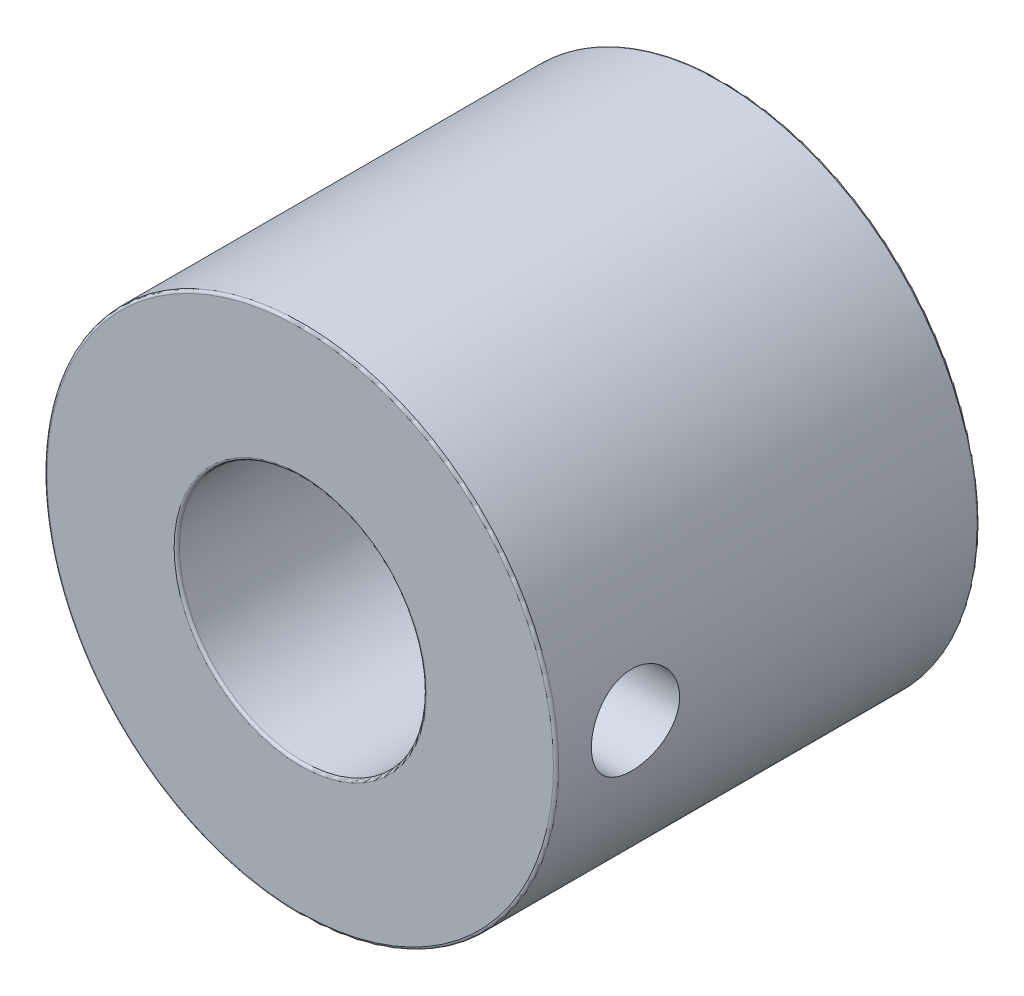
ISO-10303-21;
HEADER;
FILE_DESCRIPTION(('STEP AP214'),'2;1');
FILE_NAME('part.step','',(''),(''),'','','');
FILE_SCHEMA(('AUTOMOTIVE_DESIGN { 1 0 10303 214 1 1 1 1 }'));
ENDSEC;
DATA;
#1=APPLICATION_CONTEXT('core data for automotive mechanical design processes');
#2=APPLICATION_PROTOCOL_DEFINITION('international standard','automotive_design',2000,#1);
#3=PRODUCT_CONTEXT('',#1,'mechanical');
#4=PRODUCT('Part','Part','',(#3));
#5=PRODUCT_RELATED_PRODUCT_CATEGORY('part','',(#4));
#6=PRODUCT_DEFINITION_FORMATION('','',#4);
#7=PRODUCT_DEFINITION_CONTEXT('part definition',#1,'design');
#8=PRODUCT_DEFINITION('design','',#6,#7);
#9=PRODUCT_DEFINITION_SHAPE('','',#8);
#10=(LENGTH_UNIT() NAMED_UNIT(*) SI_UNIT(.MILLI.,.METRE.));
#11=(NAMED_UNIT(*) PLANE_ANGLE_UNIT() SI_UNIT($,.RADIAN.));
#12=(NAMED_UNIT(*) SI_UNIT($,.STERADIAN.) SOLID_ANGLE_UNIT());
#13=UNCERTAINTY_MEASURE_WITH_UNIT(LENGTH_MEASURE(1.E-05),#10,'distance_accuracy_value','');
#14=(GEOMETRIC_REPRESENTATION_CONTEXT(3) GLOBAL_UNCERTAINTY_ASSIGNED_CONTEXT((#13)) GLOBAL_UNIT_ASSIGNED_CONTEXT((#10,
#11,#12)) REPRESENTATION_CONTEXT('',''));
#15=CARTESIAN_POINT('',(0.,0.,0.));
#16=DIRECTION('',(0.,0.,1.));
#17=DIRECTION('',(1.,0.,0.));
#18=AXIS2_PLACEMENT_3D('',#15,#16,#17);
#19=CARTESIAN_POINT('',(0.,0.,48.));
#20=DIRECTION('',(0.,0.,-1.));
#21=DIRECTION('',(-1.,0.,0.));
#22=AXIS2_PLACEMENT_3D('',#19,#20,#21);
#23=CYLINDRICAL_SURFACE('',#22,29.);
#24=CARTESIAN_POINT('',(0.,0.,0.300000000000002));
#25=DIRECTION('',(0.,0.,1.));
#26=DIRECTION('',(1.,0.,0.));
#27=AXIS2_PLACEMENT_3D('',#24,#25,#26);
#28=CIRCLE('',#27,29.);
#29=CARTESIAN_POINT('',(29.,0.,0.300000000000002));
#30=VERTEX_POINT('',#29);
#31=EDGE_CURVE('E45',#30,#30,#28,.T.);
#32=ORIENTED_EDGE('',*,*,#31,.T.);
#33=EDGE_LOOP('',(#32));
#34=FACE_BOUND('',#33,.T.);
#35=CARTESIAN_POINT('',(0.,0.,47.7));
#36=DIRECTION('',(0.,0.,1.));
#37=DIRECTION('',(1.,0.,0.));
#38=AXIS2_PLACEMENT_3D('',#35,#36,#37);
#39=CIRCLE('',#38,29.);
#40=CARTESIAN_POINT('',(29.,0.,47.7));
#41=VERTEX_POINT('',#40);
#42=EDGE_CURVE('E50',#41,#41,#39,.F.);
#43=ORIENTED_EDGE('',*,*,#42,.T.);
#44=EDGE_LOOP('',(#43));
#45=FACE_BOUND('',#44,.T.);
#46=CARTESIAN_POINT('',(29.,0.,44.));
#47=CARTESIAN_POINT('',(29.0000010041572,-0.139366730999687,44.0000022424494));
#48=CARTESIAN_POINT('',(28.9989935146445,-0.278703487001926,43.994171314866));
#49=CARTESIAN_POINT('',(28.994993867993,-0.556417735275305,43.9708962986049));
#50=CARTESIAN_POINT('',(28.9920013271478,-0.694795036859398,43.9534499646898));
#51=CARTESIAN_POINT('',(28.984111586466,-0.969636236419775,43.9070605975793));
#52=CARTESIAN_POINT('',(28.979213219881,-1.10609890913449,43.8781105215499));
#53=CARTESIAN_POINT('',(28.9676472717491,-1.37610961672308,43.8089241555845));
#54=CARTESIAN_POINT('',(28.9609790409012,-1.50965656241991,43.7686837233038));
#55=CARTESIAN_POINT('',(28.946069273448,-1.77268338632854,43.6772807318518));
#56=CARTESIAN_POINT('',(28.9378296681615,-1.90216803220604,43.6261315711629));
#57=CARTESIAN_POINT('',(28.9199968020457,-2.15639281462493,43.5132384210894));
#58=CARTESIAN_POINT('',(28.9104030425439,-2.28113118175026,43.4514905268625));
#59=CARTESIAN_POINT('',(28.8901337262248,-2.52490140722549,43.3178909084556));
#60=CARTESIAN_POINT('',(28.8794586996812,-2.64393602101406,43.2460441303194));
#61=CARTESIAN_POINT('',(28.857311924844,-2.87560362060131,43.092701707488));
#62=CARTESIAN_POINT('',(28.845839880792,-2.98823420148496,43.0112024729533));
#63=CARTESIAN_POINT('',(28.822314330975,-3.20724727882162,42.8383841853778));
#64=CARTESIAN_POINT('',(28.8102566089828,-3.31356633507422,42.7469852994865));
#65=CARTESIAN_POINT('',(28.7859860257027,-3.51818559038157,42.5555598480556));
#66=CARTESIAN_POINT('',(28.773773108623,-3.61648280562814,42.4555301003811));
#67=CARTESIAN_POINT('',(28.7495421021919,-3.80431278584603,42.2475880390735));
#68=CARTESIAN_POINT('',(28.7375239551961,-3.8938481850112,42.1396781117177));
#69=CARTESIAN_POINT('',(28.7140124442942,-4.06359897737724,41.9166437638695));
#70=CARTESIAN_POINT('',(28.7025192755697,-4.14381092105733,41.8015166972545));
#71=CARTESIAN_POINT('',(28.6803190626315,-4.29478283149526,41.5641273676565));
#72=CARTESIAN_POINT('',(28.6696173942142,-4.36548043758763,41.4418249237761));
#73=CARTESIAN_POINT('',(28.6493866187259,-4.49633534516225,41.1915562431469));
#74=CARTESIAN_POINT('',(28.6398579503694,-4.55648870652884,41.0635879114789));
#75=CARTESIAN_POINT('',(28.6222613754863,-4.66575019828046,40.8029751096425));
#76=CARTESIAN_POINT('',(28.6141928465321,-4.7148630371878,40.6703326609002));
#77=CARTESIAN_POINT('',(28.5997455791012,-4.80171459398211,40.4012711898842));
#78=CARTESIAN_POINT('',(28.593367457065,-4.83944916324682,40.2648508098883));
#79=CARTESIAN_POINT('',(28.5771897834046,-4.93442482022914,39.8542017173274));
#80=CARTESIAN_POINT('',(28.5701461492155,-4.97464175167428,39.5757017993137));
#81=CARTESIAN_POINT('',(28.5643450518137,-5.00783867312309,39.0159776343015));
#82=CARTESIAN_POINT('',(28.5655869610415,-5.00082224065142,38.7347535952431));
#83=CARTESIAN_POINT('',(28.576134358113,-4.94018803659679,38.1806611696438));
#84=CARTESIAN_POINT('',(28.5853505121813,-4.88708652647722,37.9077347702711));
#85=CARTESIAN_POINT('',(28.6106718391743,-4.73658363161879,37.3747346061418));
#86=CARTESIAN_POINT('',(28.6267772634383,-4.63918063063214,37.1146613106877));
#87=CARTESIAN_POINT('',(28.6641571529568,-4.40232551215854,36.6132000359109));
#88=CARTESIAN_POINT('',(28.6854576767706,-4.26266053134075,36.3719146081918));
#89=CARTESIAN_POINT('',(28.7308101505286,-3.94539580489147,35.9160094833518));
#90=CARTESIAN_POINT('',(28.754862337655,-3.76779278801162,35.7013920882365));
#91=CARTESIAN_POINT('',(28.8033998143189,-3.37688791907062,35.3019264873065));
#92=CARTESIAN_POINT('',(28.8278866139267,-3.16314334976661,35.1175114183905));
#93=CARTESIAN_POINT('',(28.8742395282066,-2.70751578724515,34.7870972200359));
#94=CARTESIAN_POINT('',(28.8961056237204,-2.46563258834985,34.6410983714242));
#95=CARTESIAN_POINT('',(28.9347877434901,-1.96017493788063,34.391615094034));
#96=CARTESIAN_POINT('',(28.9515990057832,-1.69658032871544,34.2881707206243));
#97=CARTESIAN_POINT('',(28.9782394811635,-1.15540370028351,34.1271442505753));
#98=CARTESIAN_POINT('',(28.9880693198462,-0.877822936684406,34.0695580445936));
#99=CARTESIAN_POINT('',(28.9995547913353,-0.320284941882539,34.0024738874067));
#100=CARTESIAN_POINT('',(29.0013114394535,-0.0404012282032698,33.9923816324154));
#101=CARTESIAN_POINT('',(28.9967299015726,0.517056874429956,34.0189848576703));
#102=CARTESIAN_POINT('',(28.9903920496879,0.7946313582254,34.0556784067509));
#103=CARTESIAN_POINT('',(28.9703962675713,1.33774292205082,34.174317341895));
#104=CARTESIAN_POINT('',(28.9567862279156,1.60334656583138,34.2559667794515));
#105=CARTESIAN_POINT('',(28.9237658700363,2.11709545870728,34.4618830847517));
#106=CARTESIAN_POINT('',(28.9043552073953,2.36523967005135,34.58615248316));
#107=CARTESIAN_POINT('',(28.8616356376916,2.83959538930937,34.8751298853753));
#108=CARTESIAN_POINT('',(28.8382918064097,3.06557883504362,35.0402069868542));
#109=CARTESIAN_POINT('',(28.7903962824341,3.48684889826849,35.4056093510139));
#110=CARTESIAN_POINT('',(28.7658444955532,3.6821331170692,35.6059373654422));
#111=CARTESIAN_POINT('',(28.7179711467065,4.03867934173458,36.0388234958714));
#112=CARTESIAN_POINT('',(28.6946663084093,4.19953870802048,36.271715358476));
#113=CARTESIAN_POINT('',(28.6522446660876,4.47985077256473,36.7615756460067));
#114=CARTESIAN_POINT('',(28.6331277227411,4.59930484836228,37.0185432695794));
#115=CARTESIAN_POINT('',(28.6013712766186,4.79282611598803,37.5481089359185));
#116=CARTESIAN_POINT('',(28.5887038141159,4.86708949649444,37.8206337143807));
#117=CARTESIAN_POINT('',(28.571219912611,4.96871854072435,38.3746834102611));
#118=CARTESIAN_POINT('',(28.5664027381917,4.99608859743879,38.6562074821035));
#119=CARTESIAN_POINT('',(28.5654748048149,5.00135250942943,39.0767706540787));
#120=CARTESIAN_POINT('',(28.5661913921757,4.99727688543392,39.2158053750216));
#121=CARTESIAN_POINT('',(28.5696329683345,4.97757021228369,39.4930143513359));
#122=CARTESIAN_POINT('',(28.5723572013667,4.96194351145368,39.6311889107763));
#123=CARTESIAN_POINT('',(28.5797395705759,4.91924238538872,39.9057448166914));
#124=CARTESIAN_POINT('',(28.5843983952443,4.89216388456995,40.0421255069109));
#125=CARTESIAN_POINT('',(28.5955116540725,4.82678085002326,40.3120438266035));
#126=CARTESIAN_POINT('',(28.6019654428131,4.78848035114943,40.4455824594559));
#127=CARTESIAN_POINT('',(28.6164768328185,4.70098030566849,40.7088012297529));
#128=CARTESIAN_POINT('',(28.6245328427721,4.65179156772486,40.8384850500263));
#129=CARTESIAN_POINT('',(28.6420203727133,4.54287443064862,41.0931961655395));
#130=CARTESIAN_POINT('',(28.6514514007742,4.48314979924044,41.2182251061111));
#131=CARTESIAN_POINT('',(28.6714298538147,4.35355121249048,41.4628768189198));
#132=CARTESIAN_POINT('',(28.6819777202866,4.28367323938171,41.5824974263475));
#133=CARTESIAN_POINT('',(28.7038889424544,4.13430201419716,41.8154366814547));
#134=CARTESIAN_POINT('',(28.7152520120228,4.05481212914744,41.9287575157386));
#135=CARTESIAN_POINT('',(28.7386352656951,3.88564364103337,42.1498250011507));
#136=CARTESIAN_POINT('',(28.7506620944525,3.79584551194426,42.2574795045769));
#137=CARTESIAN_POINT('',(28.7748918319318,3.6075756882054,42.4648232657103));
#138=CARTESIAN_POINT('',(28.7870946764085,3.50910709445367,42.5645153469614));
#139=CARTESIAN_POINT('',(28.8113468717635,3.30408094234383,42.7553527380429));
#140=CARTESIAN_POINT('',(28.8233961268922,3.19751860112346,42.8464929220455));
#141=CARTESIAN_POINT('',(28.8469930440314,2.97712413173047,43.0194963434016));
#142=CARTESIAN_POINT('',(28.8585408894798,2.86329470047982,43.1013629913644));
#143=CARTESIAN_POINT('',(28.8809050923807,2.62818765872045,43.2558867171667));
#144=CARTESIAN_POINT('',(28.8917150057657,2.50685865476556,43.3284665668212));
#145=CARTESIAN_POINT('',(28.9121923920832,2.25846290248807,43.4631038536355));
#146=CARTESIAN_POINT('',(28.9218602850511,2.13139828764012,43.525165163192));
#147=CARTESIAN_POINT('',(28.9397768246268,1.87246873244622,43.6382975502436));
#148=CARTESIAN_POINT('',(28.9480264356427,1.740607128485,43.6893761018016));
#149=CARTESIAN_POINT('',(28.9628773918787,1.47299176899593,43.7801952783112));
#150=CARTESIAN_POINT('',(28.9694790850081,1.3372388417645,43.819938296679));
#151=CARTESIAN_POINT('',(28.983275327006,1.00405515934851,43.9023030068049));
#152=CARTESIAN_POINT('',(28.9895172784288,0.805061904222418,43.9388948625982));
#153=CARTESIAN_POINT('',(28.9978788476899,0.40402474044416,43.9877415005305));
#154=CARTESIAN_POINT('',(28.9999985446989,0.201980890455928,43.9999967500714));
#155=CARTESIAN_POINT('',(29.,0.,44.));
#156=B_SPLINE_CURVE_WITH_KNOTS('',3,(#46,#47,#48,#49,#50,#51,#52,#53,#54,#55,#56,#57,#58,#59,
#60,#61,#62,#63,#64,#65,#66,#67,#68,#69,#70,#71,#72,#73,#74,#75,#76,#77,#78,#79,#80,#81,#82,#83,
#84,#85,#86,#87,#88,#89,#90,#91,#92,#93,#94,#95,#96,#97,#98,#99,#100,#101,#102,#103,#104,#105,
#106,#107,#108,#109,#110,#111,#112,#113,#114,#115,#116,#117,#118,#119,#120,#121,#122,#123,#124,
#125,#126,#127,#128,#129,#130,#131,#132,#133,#134,#135,#136,#137,#138,#139,#140,#141,#142,#143,
#144,#145,#146,#147,#148,#149,#150,#151,#152,#153,#154,#155),.UNSPECIFIED.,.T.,.F.,(4,2,2,2,2,2,
2,2,2,2,2,2,2,2,2,2,2,2,2,2,2,2,2,2,2,2,2,2,2,2,2,2,2,2,2,2,2,2,2,2,2,2,2,2,2,2,2,2,2,2,2,2,2,2,
4),(0.,0.417923102553967,0.835927012358662,1.2541872282433,1.67260110169198,2.09050399409306,
2.50856118430128,2.92641433504709,3.34442338021042,3.76609743729152,4.18792763229172,
4.60963061411037,5.03148912558549,5.45599040689023,5.88064997691835,6.30512809461535,
6.72976079433283,7.56975479740566,8.40968517880939,9.24032606712403,10.0709972620759,
10.9059240272709,11.7409228140144,12.5870092660533,13.4331019029055,14.2799891314406,
15.1268004620138,15.9629867402739,16.7991385046063,17.6298505052784,18.4606118400541,
19.2991813551393,20.1378163594807,20.9857805877793,21.8337166019031,22.6779446650703,
23.5220936361884,23.9389759618157,24.3557014347821,24.7725753412475,25.189299544815,
25.6056119102908,26.0217756996391,26.4381046194388,26.8542881205755,27.2759079760025,
27.697377651377,28.119098354387,28.5406634504369,28.9655333425465,29.3902464775927,
29.8146696626615,30.2390031673817,30.8447008187417,31.4503868371369),.UNSPECIFIED.);
#157=CARTESIAN_POINT('',(29.,0.,44.));
#158=VERTEX_POINT('',#157);
#159=EDGE_CURVE('E87',#158,#158,#156,.T.);
#160=ORIENTED_EDGE('',*,*,#159,.F.);
#161=EDGE_LOOP('',(#160));
#162=FACE_BOUND('',#161,.T.);
#163=ADVANCED_FACE('F37',(#34,#45,#162),#23,.T.);
#164=CARTESIAN_POINT('',(0.,0.,0.));
#165=DIRECTION('',(0.,0.,1.));
#166=DIRECTION('',(1.,0.,0.));
#167=AXIS2_PLACEMENT_3D('',#164,#165,#166);
#168=CYLINDRICAL_SURFACE('',#167,14.);
#169=CARTESIAN_POINT('',(0.,0.,25.3));
#170=DIRECTION('',(0.,0.,-1.));
#171=DIRECTION('',(-1.,0.,0.));
#172=AXIS2_PLACEMENT_3D('',#169,#170,#171);
#173=CIRCLE('',#172,14.);
#174=CARTESIAN_POINT('',(-14.,0.,25.3));
#175=VERTEX_POINT('',#174);
#176=EDGE_CURVE('E69',#175,#175,#173,.T.);
#177=ORIENTED_EDGE('',*,*,#176,.T.);
#178=EDGE_LOOP('',(#177));
#179=FACE_BOUND('',#178,.T.);
#180=CARTESIAN_POINT('',(0.,0.,47.7));
#181=DIRECTION('',(0.,0.,1.));
#182=DIRECTION('',(1.,0.,0.));
#183=AXIS2_PLACEMENT_3D('',#180,#181,#182);
#184=CIRCLE('',#183,14.);
#185=CARTESIAN_POINT('',(14.,0.,47.7));
#186=VERTEX_POINT('',#185);
#187=EDGE_CURVE('E73',#186,#186,#184,.T.);
#188=ORIENTED_EDGE('',*,*,#187,.T.);
#189=EDGE_LOOP('',(#188));
#190=FACE_BOUND('',#189,.T.);
#191=CARTESIAN_POINT('',(14.,0.,34.));
#192=CARTESIAN_POINT('',(14.0000002519426,-0.135809737919824,33.9999996489062));
#193=CARTESIAN_POINT('',(13.9980194471187,-0.271614291106981,34.0055376206375));
#194=CARTESIAN_POINT('',(13.9901497229004,-0.542257020230889,34.0276367317464));
#195=CARTESIAN_POINT('',(13.9842594799445,-0.677094853246565,34.0442016043471));
#196=CARTESIAN_POINT('',(13.9687325117163,-0.944706220002116,34.0881866642127));
#197=CARTESIAN_POINT('',(13.9590974054114,-1.07748062003744,34.115602160664));
#198=CARTESIAN_POINT('',(13.9363349467423,-1.34013264362942,34.1810403733551));
#199=CARTESIAN_POINT('',(13.9232062410631,-1.47000912344286,34.2190672003827));
#200=CARTESIAN_POINT('',(13.8938342150931,-1.72565362119309,34.3052935205961));
#201=CARTESIAN_POINT('',(13.8775979412044,-1.85143019462852,34.3534700238517));
#202=CARTESIAN_POINT('',(13.8424113291469,-2.09839082390053,34.4596418228038));
#203=CARTESIAN_POINT('',(13.8234599859859,-2.21957315806502,34.5176407557604));
#204=CARTESIAN_POINT('',(13.7632361558461,-2.5750514260562,34.7057203979632));
#205=CARTESIAN_POINT('',(13.7185691156471,-2.80148404260274,34.8499537032511));
#206=CARTESIAN_POINT('',(13.6229449969461,-3.23521018737559,35.1776926987683));
#207=CARTESIAN_POINT('',(13.5718218038497,-3.44154890844615,35.3624025243698));
#208=CARTESIAN_POINT('',(13.4698651943805,-3.82117539449033,35.7635276745051));
#209=CARTESIAN_POINT('',(13.4190318586256,-3.99445436166886,35.9799514116651));
#210=CARTESIAN_POINT('',(13.3463548051795,-4.22869107129882,36.3281624471916));
#211=CARTESIAN_POINT('',(13.322357427084,-4.30350471308028,36.4504050494653));
#212=CARTESIAN_POINT('',(13.276649558234,-4.44251308945513,36.7011753500471));
#213=CARTESIAN_POINT('',(13.2549381581178,-4.5067120524072,36.8297005191309));
#214=CARTESIAN_POINT('',(13.2144936706828,-4.62396036382352,37.0922090905549));
#215=CARTESIAN_POINT('',(13.1957610120845,-4.67700810768227,37.2261932751137));
#216=CARTESIAN_POINT('',(13.161913454543,-4.77143074296403,37.4985963048509));
#217=CARTESIAN_POINT('',(13.1467968545773,-4.81281112444964,37.6370130300438));
#218=CARTESIAN_POINT('',(13.121191024673,-4.88217802905966,37.9120250140659));
#219=CARTESIAN_POINT('',(13.1105496468107,-4.91060827509872,38.0484942249662));
#220=CARTESIAN_POINT('',(13.0934633224998,-4.95598710062016,38.3235328952594));
#221=CARTESIAN_POINT('',(13.0870165796139,-4.97294059537926,38.4621014295218));
#222=CARTESIAN_POINT('',(13.0785367055753,-4.99519971662274,38.7402904458839));
#223=CARTESIAN_POINT('',(13.0765030776297,-5.00050665418347,38.8799108078016));
#224=CARTESIAN_POINT('',(13.0769196730582,-4.999417266875,39.1590965394367));
#225=CARTESIAN_POINT('',(13.0793697443865,-4.9930213388595,39.2986619108584));
#226=CARTESIAN_POINT('',(13.0884164555786,-4.96925582787826,39.5691454428228));
#227=CARTESIAN_POINT('',(13.0947832015803,-4.95249439155337,39.7001252680759));
#228=CARTESIAN_POINT('',(13.1112572434917,-4.90871467197178,39.9601626011858));
#229=CARTESIAN_POINT('',(13.1213657892446,-4.88169296148015,40.0892194517263));
#230=CARTESIAN_POINT('',(13.1450167120839,-4.817644659942,40.3444711018331));
#231=CARTESIAN_POINT('',(13.1585581647139,-4.78062076223466,40.4706666619723));
#232=CARTESIAN_POINT('',(13.1886773774888,-4.69688836619737,40.7194463048664));
#233=CARTESIAN_POINT('',(13.2052562987683,-4.65017616340986,40.8420289856502));
#234=CARTESIAN_POINT('',(13.2594921589773,-4.49423824121893,41.2074006206498));
#235=CARTESIAN_POINT('',(13.3012259345047,-4.37029651313278,41.4434997683801));
#236=CARTESIAN_POINT('',(13.3908924158961,-4.08729285529161,41.8921522229325));
#237=CARTESIAN_POINT('',(13.4388271130899,-3.92821963194589,42.1046979250449));
#238=CARTESIAN_POINT('',(13.5390490871924,-3.56806665841638,42.5139076673079));
#239=CARTESIAN_POINT('',(13.5914242329658,-3.36502761599936,42.7088326312144));
#240=CARTESIAN_POINT('',(13.6921097086614,-2.92852270488315,43.0623464533435));
#241=CARTESIAN_POINT('',(13.7404195241964,-2.69505299528129,43.2209307177292));
#242=CARTESIAN_POINT('',(13.8283399097023,-2.20020095435867,43.4989603760333));
#243=CARTESIAN_POINT('',(13.8678306254663,-1.93849829448506,43.6178762502915));
#244=CARTESIAN_POINT('',(13.9327833716819,-1.39704686664781,43.8094318777166));
#245=CARTESIAN_POINT('',(13.9582510295517,-1.11730538803626,43.8820901957571));
#246=CARTESIAN_POINT('',(13.991324045948,-0.562410193206383,43.9758382307177));
#247=CARTESIAN_POINT('',(13.9997420700812,-0.287701200751388,43.999276193498));
#248=CARTESIAN_POINT('',(14.000245967713,0.261818717565057,44.0006903119603));
#249=CARTESIAN_POINT('',(13.9923350700279,0.536629612533592,43.9786754553026));
#250=CARTESIAN_POINT('',(13.96160696813,1.06873750606474,43.8916275309154));
#251=CARTESIAN_POINT('',(13.939308240694,1.32631209719197,43.8280897873378));
#252=CARTESIAN_POINT('',(13.882565031643,1.82699848697875,43.6617275116848));
#253=CARTESIAN_POINT('',(13.8481189730829,2.07010840306846,43.5588978786607));
#254=CARTESIAN_POINT('',(13.7693143482216,2.54263735557131,43.3136796092455));
#255=CARTESIAN_POINT('',(13.7247035735895,2.77147674291151,43.1702568930472));
#256=CARTESIAN_POINT('',(13.6305695865086,3.20255291901187,42.8491551592249));
#257=CARTESIAN_POINT('',(13.5810446916018,3.40478054113731,42.6714643893896));
#258=CARTESIAN_POINT('',(13.4793142279669,3.78806872243883,42.2757008253064));
#259=CARTESIAN_POINT('',(13.4271043972475,3.96746111928894,42.0559979903404));
#260=CARTESIAN_POINT('',(13.353186072821,4.20707029265235,41.7056737540284));
#261=CARTESIAN_POINT('',(13.3292666629599,4.282062011313,41.5853608633976));
#262=CARTESIAN_POINT('',(13.2835956994504,4.4217048104309,41.3385037914957));
#263=CARTESIAN_POINT('',(13.2618432357766,4.4863602386487,41.2119622596321));
#264=CARTESIAN_POINT('',(13.2211521289455,4.60489690992007,40.9532560459585));
#265=CARTESIAN_POINT('',(13.2022179096588,4.65876125884398,40.8210829337869));
#266=CARTESIAN_POINT('',(13.1678303323927,4.75508788562331,40.5522602584935));
#267=CARTESIAN_POINT('',(13.1523755162917,4.79755494120744,40.4156125981343));
#268=CARTESIAN_POINT('',(13.12547110679,4.87068051581479,40.1388390355153));
#269=CARTESIAN_POINT('',(13.1140205488036,4.90134187889161,39.9987139796477));
#270=CARTESIAN_POINT('',(13.0955286528397,4.95053767017168,39.7160657004277));
#271=CARTESIAN_POINT('',(13.0884870464724,4.96907283654582,39.5735426235944));
#272=CARTESIAN_POINT('',(13.0793469225384,4.9930788546979,39.2957127516861));
#273=CARTESIAN_POINT('',(13.0769817579263,4.99925470157819,39.160475192421));
#274=CARTESIAN_POINT('',(13.0764603957771,5.00061847355673,38.8898883107568));
#275=CARTESIAN_POINT('',(13.0783056225173,4.99580268043916,38.7545389660252));
#276=CARTESIAN_POINT('',(13.0861457297444,4.97522963503318,38.4848595829593));
#277=CARTESIAN_POINT('',(13.0921387237547,4.95947735683807,38.3505291092925));
#278=CARTESIAN_POINT('',(13.1080794092757,4.91719059273383,38.0837665065739));
#279=CARTESIAN_POINT('',(13.1180285884568,4.89065205071166,37.9513351110759));
#280=CARTESIAN_POINT('',(13.1412661885936,4.82785805334529,37.692699377124));
#281=CARTESIAN_POINT('',(13.1544628914362,4.79186791799649,37.5664223757394));
#282=CARTESIAN_POINT('',(13.1839237471819,4.71020497541157,37.3173923367375));
#283=CARTESIAN_POINT('',(13.2001889807938,4.6645287561192,37.1946405582751));
#284=CARTESIAN_POINT('',(13.2529164837268,4.51349426075883,36.8328507031323));
#285=CARTESIAN_POINT('',(13.2933294326143,4.3940816819264,36.6000802155087));
#286=CARTESIAN_POINT('',(13.3825459898299,4.11460292355305,36.1461153839393));
#287=CARTESIAN_POINT('',(13.4316625088261,3.95283925958625,35.9260378771458));
#288=CARTESIAN_POINT('',(13.5316137261424,3.59578542291728,35.5151310275802));
#289=CARTESIAN_POINT('',(13.5824489402755,3.40048511219727,35.3243105622296));
#290=CARTESIAN_POINT('',(13.6572247632491,3.08107053558581,35.0595151725912));
#291=CARTESIAN_POINT('',(13.6824529349607,2.96730195298126,34.973145743924));
#292=CARTESIAN_POINT('',(13.7312573259649,2.73256556739149,34.8103154305465));
#293=CARTESIAN_POINT('',(13.7548341552065,2.6116004534161,34.7338508783567));
#294=CARTESIAN_POINT('',(13.7996836066846,2.36319109186863,34.5913898114045));
#295=CARTESIAN_POINT('',(13.8209553479672,2.23574439432751,34.5253972943808));
#296=CARTESIAN_POINT('',(13.8605711546424,1.97532322487609,34.4044919282371));
#297=CARTESIAN_POINT('',(13.8789164945784,1.84235119141244,34.3495742528936));
#298=CARTESIAN_POINT('',(13.9122340622159,1.57114424812455,34.2510614421704));
#299=CARTESIAN_POINT('',(13.9271900336805,1.43288754312077,34.2075207270477));
#300=CARTESIAN_POINT('',(13.953163193027,1.15282395672585,34.1325571177426));
#301=CARTESIAN_POINT('',(13.9641820514713,1.01101860846044,34.1011290835637));
#302=CARTESIAN_POINT('',(13.9819512046771,0.724964125001943,34.0507054044607));
#303=CARTESIAN_POINT('',(13.9887019632778,0.580715257110368,34.0317084085756));
#304=CARTESIAN_POINT('',(13.9977260889503,0.290975558507285,34.0063562813388));
#305=CARTESIAN_POINT('',(13.9999997301091,0.145484804371126,34.0000003761057));
#306=CARTESIAN_POINT('',(14.,0.,34.));
#307=B_SPLINE_CURVE_WITH_KNOTS('',3,(#191,#192,#193,#194,#195,#196,#197,#198,#199,#200,#201,
#202,#203,#204,#205,#206,#207,#208,#209,#210,#211,#212,#213,#214,#215,#216,#217,#218,#219,#220,
#221,#222,#223,#224,#225,#226,#227,#228,#229,#230,#231,#232,#233,#234,#235,#236,#237,#238,#239,
#240,#241,#242,#243,#244,#245,#246,#247,#248,#249,#250,#251,#252,#253,#254,#255,#256,#257,#258,
#259,#260,#261,#262,#263,#264,#265,#266,#267,#268,#269,#270,#271,#272,#273,#274,#275,#276,#277,
#278,#279,#280,#281,#282,#283,#284,#285,#286,#287,#288,#289,#290,#291,#292,#293,#294,#295,#296,
#297,#298,#299,#300,#301,#302,#303,#304,#305,#306),.UNSPECIFIED.,.T.,.F.,(4,2,2,2,2,2,2,2,2,2,2,
2,2,2,2,2,2,2,2,2,2,2,2,2,2,2,2,2,2,2,2,2,2,2,2,2,2,2,2,2,2,2,2,2,2,2,2,2,2,2,2,2,2,2,2,2,2,4),
(0.,0.407293549367724,0.814725060573495,1.22198062785582,1.62939418390025,2.03589464693377,
2.44254596814073,3.25520135843811,4.09647500881856,4.93797222592689,5.37346750186923,
5.80878887805696,6.24417285203164,6.67935161341721,7.098226208036,7.51692129285397,
7.93556924190606,8.35420299452807,8.75034112612816,9.14661169614764,9.54277566657626,
9.93909139597209,10.7449687808383,11.5511056061663,12.4060188501517,13.2610401043917,
14.1270562827215,14.9927246771604,15.8160563856906,16.6392253074655,17.4342723235055,
18.2294225891648,19.0470029265114,19.8648641528353,20.7256534802194,21.1565526491281,
21.5872700890202,22.0186566639974,22.449862118888,22.8809636290183,23.3120388938047,
23.7177313781028,24.1235611190587,24.5292064027856,24.935004368452,25.330444148891,
25.7260234605165,26.5165753855613,27.3456507182852,28.1749771203856,28.6096896421885,
29.0442407400284,29.4789573323412,29.9134840713814,30.3500527626513,30.7864359921976,
31.2227717892929,31.6590808733025),.UNSPECIFIED.);
#308=CARTESIAN_POINT('',(14.,0.,34.));
#309=VERTEX_POINT('',#308);
#310=EDGE_CURVE('E78',#309,#309,#307,.T.);
#311=ORIENTED_EDGE('',*,*,#310,.F.);
#312=EDGE_LOOP('',(#311));
#313=FACE_BOUND('',#312,.T.);
#314=ADVANCED_FACE('F90',(#179,#190,#313),#168,.F.);
#315=CARTESIAN_POINT('',(0.,0.,48.));
#316=DIRECTION('',(0.,0.,1.));
#317=DIRECTION('',(1.,0.,0.));
#318=AXIS2_PLACEMENT_3D('',#315,#316,#317);
#319=PLANE('',#318);
#320=CARTESIAN_POINT('',(0.,0.,48.));
#321=DIRECTION('',(0.,0.,1.));
#322=DIRECTION('',(1.,0.,0.));
#323=AXIS2_PLACEMENT_3D('',#320,#321,#322);
#324=CIRCLE('',#323,14.3);
#325=CARTESIAN_POINT('',(14.3,0.,48.));
#326=VERTEX_POINT('',#325);
#327=EDGE_CURVE('E55',#326,#326,#324,.F.);
#328=ORIENTED_EDGE('',*,*,#327,.T.);
#329=EDGE_LOOP('',(#328));
#330=FACE_BOUND('',#329,.T.);
#331=CARTESIAN_POINT('',(0.,0.,48.));
#332=DIRECTION('',(0.,0.,1.));
#333=DIRECTION('',(1.,0.,0.));
#334=AXIS2_PLACEMENT_3D('',#331,#332,#333);
#335=CIRCLE('',#334,28.7);
#336=CARTESIAN_POINT('',(28.7,0.,48.));
#337=VERTEX_POINT('',#336);
#338=EDGE_CURVE('E61',#337,#337,#335,.T.);
#339=ORIENTED_EDGE('',*,*,#338,.T.);
#340=EDGE_LOOP('',(#339));
#341=FACE_BOUND('',#340,.T.);
#342=ADVANCED_FACE('F133',(#330,#341),#319,.T.);
#343=CARTESIAN_POINT('',(0.,0.,0.));
#344=DIRECTION('',(0.,0.,1.));
#345=DIRECTION('',(1.,0.,0.));
#346=AXIS2_PLACEMENT_3D('',#343,#344,#345);
#347=PLANE('',#346);
#348=CARTESIAN_POINT('',(0.,0.,0.));
#349=DIRECTION('',(0.,0.,1.));
#350=DIRECTION('',(1.,0.,0.));
#351=AXIS2_PLACEMENT_3D('',#348,#349,#350);
#352=CIRCLE('',#351,28.7);
#353=CARTESIAN_POINT('',(28.7,0.,0.));
#354=VERTEX_POINT('',#353);
#355=EDGE_CURVE('E10',#354,#354,#352,.F.);
#356=ORIENTED_EDGE('',*,*,#355,.T.);
#357=EDGE_LOOP('',(#356));
#358=FACE_BOUND('',#357,.T.);
#359=CARTESIAN_POINT('',(0.,0.,0.));
#360=DIRECTION('',(0.,0.,-1.));
#361=DIRECTION('',(-1.,0.,0.));
#362=AXIS2_PLACEMENT_3D('',#359,#360,#361);
#363=CIRCLE('',#362,24.);
#364=CARTESIAN_POINT('',(-24.,0.,0.));
#365=VERTEX_POINT('',#364);
#366=EDGE_CURVE('E88',#365,#365,#363,.T.);
#367=ORIENTED_EDGE('',*,*,#366,.F.);
#368=EDGE_LOOP('',(#367));
#369=FACE_BOUND('',#368,.T.);
#370=ADVANCED_FACE('F111',(#358,#369),#347,.F.);
#371=CARTESIAN_POINT('',(0.,0.,25.));
#372=DIRECTION('',(0.,0.,-1.));
#373=DIRECTION('',(-1.,0.,0.));
#374=AXIS2_PLACEMENT_3D('',#371,#372,#373);
#375=CYLINDRICAL_SURFACE('',#374,24.);
#376=CARTESIAN_POINT('',(0.,0.,25.));
#377=DIRECTION('',(0.,0.,-1.));
#378=DIRECTION('',(-1.,0.,0.));
#379=AXIS2_PLACEMENT_3D('',#376,#377,#378);
#380=CIRCLE('',#379,24.);
#381=CARTESIAN_POINT('',(-24.,0.,25.));
#382=VERTEX_POINT('',#381);
#383=EDGE_CURVE('E77',#382,#382,#380,.T.);
#384=ORIENTED_EDGE('',*,*,#383,.F.);
#385=EDGE_LOOP('',(#384));
#386=FACE_BOUND('',#385,.T.);
#387=ORIENTED_EDGE('',*,*,#366,.T.);
#388=EDGE_LOOP('',(#387));
#389=FACE_BOUND('',#388,.T.);
#390=ADVANCED_FACE('F140',(#386,#389),#375,.F.);
#391=CARTESIAN_POINT('',(0.,0.,25.));
#392=DIRECTION('',(0.,0.,-1.));
#393=DIRECTION('',(-1.,0.,0.));
#394=AXIS2_PLACEMENT_3D('',#391,#392,#393);
#395=PLANE('',#394);
#396=CARTESIAN_POINT('',(0.,0.,25.));
#397=DIRECTION('',(0.,0.,-1.));
#398=DIRECTION('',(-1.,0.,0.));
#399=AXIS2_PLACEMENT_3D('',#396,#397,#398);
#400=CIRCLE('',#399,14.3);
#401=CARTESIAN_POINT('',(-14.3,0.,25.));
#402=VERTEX_POINT('',#401);
#403=EDGE_CURVE('E65',#402,#402,#400,.F.);
#404=ORIENTED_EDGE('',*,*,#403,.T.);
#405=EDGE_LOOP('',(#404));
#406=FACE_BOUND('',#405,.T.);
#407=ORIENTED_EDGE('',*,*,#383,.T.);
#408=EDGE_LOOP('',(#407));
#409=FACE_BOUND('',#408,.T.);
#410=ADVANCED_FACE('F97',(#406,#409),#395,.T.);
#411=CARTESIAN_POINT('',(42.,0.,39.));
#412=DIRECTION('',(-1.,0.,0.));
#413=DIRECTION('',(0.,0.,1.));
#414=AXIS2_PLACEMENT_3D('',#411,#412,#413);
#415=CYLINDRICAL_SURFACE('',#414,5.);
#416=ORIENTED_EDGE('',*,*,#310,.T.);
#417=EDGE_LOOP('',(#416));
#418=FACE_BOUND('',#417,.T.);
#419=ORIENTED_EDGE('',*,*,#159,.T.);
#420=EDGE_LOOP('',(#419));
#421=FACE_BOUND('',#420,.T.);
#422=ADVANCED_FACE('F93',(#418,#421),#415,.F.);
#423=CARTESIAN_POINT('',(0.,0.,25.3));
#424=DIRECTION('',(0.,0.,-1.));
#425=DIRECTION('',(-1.,0.,0.));
#426=AXIS2_PLACEMENT_3D('',#423,#424,#425);
#427=TOROIDAL_SURFACE('',#426,14.3,0.3);
#428=ORIENTED_EDGE('',*,*,#403,.F.);
#429=EDGE_LOOP('',(#428));
#430=FACE_BOUND('',#429,.T.);
#431=ORIENTED_EDGE('',*,*,#176,.F.);
#432=EDGE_LOOP('',(#431));
#433=FACE_BOUND('',#432,.T.);
#434=ADVANCED_FACE('F96',(#430,#433),#427,.T.);
#435=CARTESIAN_POINT('',(0.,0.,47.7));
#436=DIRECTION('',(0.,0.,1.));
#437=DIRECTION('',(1.,0.,0.));
#438=AXIS2_PLACEMENT_3D('',#435,#436,#437);
#439=TOROIDAL_SURFACE('',#438,14.3,0.3);
#440=ORIENTED_EDGE('',*,*,#327,.F.);
#441=EDGE_LOOP('',(#440));
#442=FACE_BOUND('',#441,.T.);
#443=ORIENTED_EDGE('',*,*,#187,.F.);
#444=EDGE_LOOP('',(#443));
#445=FACE_BOUND('',#444,.T.);
#446=ADVANCED_FACE('F115',(#442,#445),#439,.T.);
#447=CARTESIAN_POINT('',(0.,0.,0.300000000000002));
#448=DIRECTION('',(0.,0.,1.));
#449=DIRECTION('',(1.,0.,0.));
#450=AXIS2_PLACEMENT_3D('',#447,#448,#449);
#451=TOROIDAL_SURFACE('',#450,28.7,0.3);
#452=ORIENTED_EDGE('',*,*,#355,.F.);
#453=EDGE_LOOP('',(#452));
#454=FACE_BOUND('',#453,.T.);
#455=ORIENTED_EDGE('',*,*,#31,.F.);
#456=EDGE_LOOP('',(#455));
#457=FACE_BOUND('',#456,.T.);
#458=ADVANCED_FACE('F118',(#454,#457),#451,.T.);
#459=CARTESIAN_POINT('',(0.,0.,47.7));
#460=DIRECTION('',(0.,0.,1.));
#461=DIRECTION('',(1.,0.,0.));
#462=AXIS2_PLACEMENT_3D('',#459,#460,#461);
#463=TOROIDAL_SURFACE('',#462,28.7,0.3);
#464=ORIENTED_EDGE('',*,*,#42,.F.);
#465=EDGE_LOOP('',(#464));
#466=FACE_BOUND('',#465,.T.);
#467=ORIENTED_EDGE('',*,*,#338,.F.);
#468=EDGE_LOOP('',(#467));
#469=FACE_BOUND('',#468,.T.);
#470=ADVANCED_FACE('F39',(#466,#469),#463,.T.);
#471=CLOSED_SHELL('',(#163,#314,#342,#370,#390,#410,#422,#434,#446,#458,#470));
#472=MANIFOLD_SOLID_BREP('B2',#471);
#473=ADVANCED_BREP_SHAPE_REPRESENTATION('',(#18,#472),#14);
#474=SHAPE_DEFINITION_REPRESENTATION(#9,#473);
ENDSEC;
END-ISO-10303-21;
